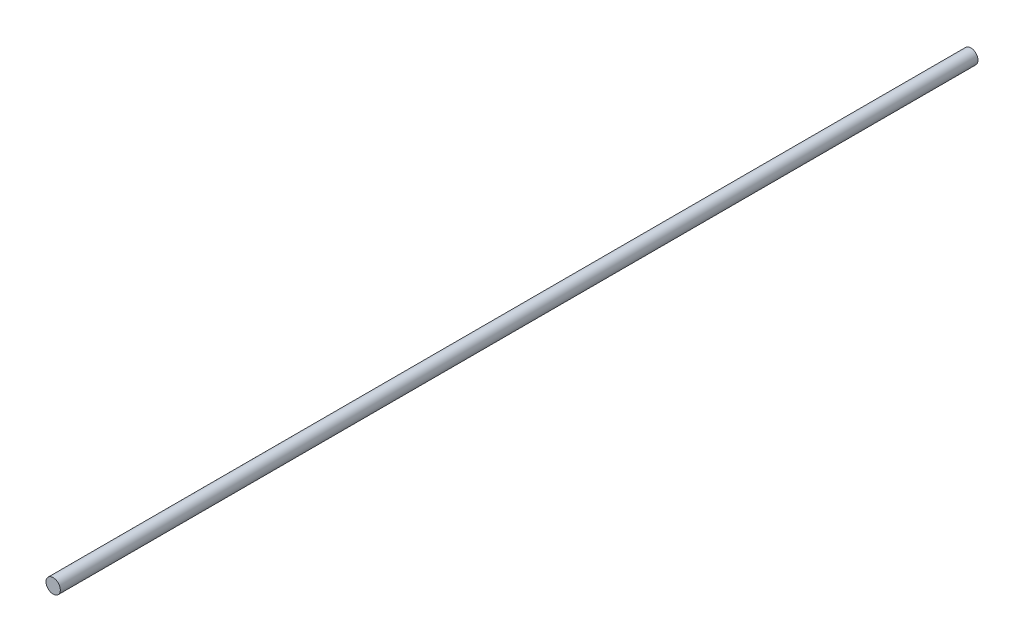
ISO-10303-21;
HEADER;
FILE_DESCRIPTION(('STEP AP214'),'2;1');
FILE_NAME('part.step','',(''),(''),'','','');
FILE_SCHEMA(('AUTOMOTIVE_DESIGN { 1 0 10303 214 1 1 1 1 }'));
ENDSEC;
DATA;
#1=APPLICATION_CONTEXT('core data for automotive mechanical design processes');
#2=APPLICATION_PROTOCOL_DEFINITION('international standard','automotive_design',2000,#1);
#3=PRODUCT_CONTEXT('',#1,'mechanical');
#4=PRODUCT('Part','Part','',(#3));
#5=PRODUCT_RELATED_PRODUCT_CATEGORY('part','',(#4));
#6=PRODUCT_DEFINITION_FORMATION('','',#4);
#7=PRODUCT_DEFINITION_CONTEXT('part definition',#1,'design');
#8=PRODUCT_DEFINITION('design','',#6,#7);
#9=PRODUCT_DEFINITION_SHAPE('','',#8);
#10=(LENGTH_UNIT() NAMED_UNIT(*) SI_UNIT(.MILLI.,.METRE.));
#11=(NAMED_UNIT(*) PLANE_ANGLE_UNIT() SI_UNIT($,.RADIAN.));
#12=(NAMED_UNIT(*) SI_UNIT($,.STERADIAN.) SOLID_ANGLE_UNIT());
#13=UNCERTAINTY_MEASURE_WITH_UNIT(LENGTH_MEASURE(1.E-05),#10,'distance_accuracy_value','');
#14=(GEOMETRIC_REPRESENTATION_CONTEXT(3) GLOBAL_UNCERTAINTY_ASSIGNED_CONTEXT((#13)) GLOBAL_UNIT_ASSIGNED_CONTEXT((#10,
#11,#12)) REPRESENTATION_CONTEXT('',''));
#15=CARTESIAN_POINT('',(0.,0.,0.));
#16=DIRECTION('',(0.,0.,1.));
#17=DIRECTION('',(1.,0.,0.));
#18=AXIS2_PLACEMENT_3D('',#15,#16,#17);
#19=CARTESIAN_POINT('',(0.,0.,406.4));
#20=DIRECTION('',(0.,0.,-1.));
#21=DIRECTION('',(-1.,0.,0.));
#22=AXIS2_PLACEMENT_3D('',#19,#20,#21);
#23=CYLINDRICAL_SURFACE('',#22,3.175);
#24=CARTESIAN_POINT('',(0.,0.,406.4));
#25=DIRECTION('',(0.,0.,1.));
#26=DIRECTION('',(1.,0.,0.));
#27=AXIS2_PLACEMENT_3D('',#24,#25,#26);
#28=CIRCLE('',#27,3.175);
#29=CARTESIAN_POINT('',(3.175,0.,406.4));
#30=VERTEX_POINT('',#29);
#31=EDGE_CURVE('E10',#30,#30,#28,.T.);
#32=ORIENTED_EDGE('',*,*,#31,.F.);
#33=EDGE_LOOP('',(#32));
#34=FACE_BOUND('',#33,.T.);
#35=CARTESIAN_POINT('',(0.,0.,0.));
#36=DIRECTION('',(0.,0.,1.));
#37=DIRECTION('',(1.,0.,0.));
#38=AXIS2_PLACEMENT_3D('',#35,#36,#37);
#39=CIRCLE('',#38,3.175);
#40=CARTESIAN_POINT('',(3.175,0.,0.));
#41=VERTEX_POINT('',#40);
#42=EDGE_CURVE('E35',#41,#41,#39,.T.);
#43=ORIENTED_EDGE('',*,*,#42,.T.);
#44=EDGE_LOOP('',(#43));
#45=FACE_BOUND('',#44,.T.);
#46=ADVANCED_FACE('F32',(#34,#45),#23,.T.);
#47=CARTESIAN_POINT('',(0.,0.,406.4));
#48=DIRECTION('',(0.,0.,1.));
#49=DIRECTION('',(1.,0.,0.));
#50=AXIS2_PLACEMENT_3D('',#47,#48,#49);
#51=PLANE('',#50);
#52=ORIENTED_EDGE('',*,*,#31,.T.);
#53=EDGE_LOOP('',(#52));
#54=FACE_BOUND('',#53,.T.);
#55=ADVANCED_FACE('F47',(#54),#51,.T.);
#56=CARTESIAN_POINT('',(0.,0.,0.));
#57=DIRECTION('',(0.,0.,1.));
#58=DIRECTION('',(1.,0.,0.));
#59=AXIS2_PLACEMENT_3D('',#56,#57,#58);
#60=PLANE('',#59);
#61=ORIENTED_EDGE('',*,*,#42,.F.);
#62=EDGE_LOOP('',(#61));
#63=FACE_BOUND('',#62,.T.);
#64=ADVANCED_FACE('F45',(#63),#60,.F.);
#65=CLOSED_SHELL('',(#46,#55,#64));
#66=MANIFOLD_SOLID_BREP('B2',#65);
#67=ADVANCED_BREP_SHAPE_REPRESENTATION('',(#18,#66),#14);
#68=SHAPE_DEFINITION_REPRESENTATION(#9,#67);
ENDSEC;
END-ISO-10303-21;
